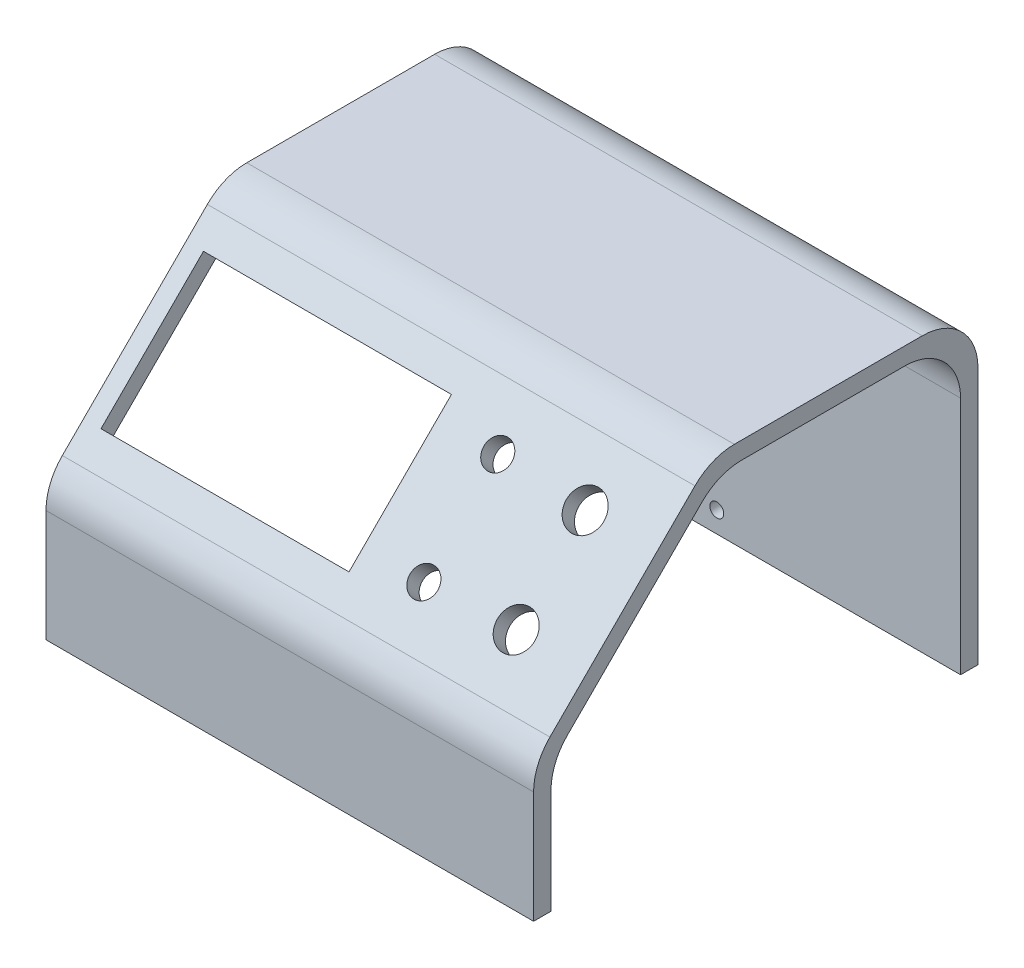
ISO-10303-21;
HEADER;
FILE_DESCRIPTION(('STEP AP214'),'2;1');
FILE_NAME('part.step','',(''),(''),'','','');
FILE_SCHEMA(('AUTOMOTIVE_DESIGN { 1 0 10303 214 1 1 1 1 }'));
ENDSEC;
DATA;
#1=APPLICATION_CONTEXT('core data for automotive mechanical design processes');
#2=APPLICATION_PROTOCOL_DEFINITION('international standard','automotive_design',2000,#1);
#3=PRODUCT_CONTEXT('',#1,'mechanical');
#4=PRODUCT('Part','Part','',(#3));
#5=PRODUCT_RELATED_PRODUCT_CATEGORY('part','',(#4));
#6=PRODUCT_DEFINITION_FORMATION('','',#4);
#7=PRODUCT_DEFINITION_CONTEXT('part definition',#1,'design');
#8=PRODUCT_DEFINITION('design','',#6,#7);
#9=PRODUCT_DEFINITION_SHAPE('','',#8);
#10=(LENGTH_UNIT() NAMED_UNIT(*) SI_UNIT(.MILLI.,.METRE.));
#11=(NAMED_UNIT(*) PLANE_ANGLE_UNIT() SI_UNIT($,.RADIAN.));
#12=(NAMED_UNIT(*) SI_UNIT($,.STERADIAN.) SOLID_ANGLE_UNIT());
#13=UNCERTAINTY_MEASURE_WITH_UNIT(LENGTH_MEASURE(1.E-05),#10,'distance_accuracy_value','');
#14=(GEOMETRIC_REPRESENTATION_CONTEXT(3) GLOBAL_UNCERTAINTY_ASSIGNED_CONTEXT((#13)) GLOBAL_UNIT_ASSIGNED_CONTEXT((#10,
#11,#12)) REPRESENTATION_CONTEXT('',''));
#15=CARTESIAN_POINT('',(0.,0.,0.));
#16=DIRECTION('',(0.,0.,1.));
#17=DIRECTION('',(1.,0.,0.));
#18=AXIS2_PLACEMENT_3D('',#15,#16,#17);
#19=CARTESIAN_POINT('',(88.9,0.,3.175));
#20=DIRECTION('',(0.,1.,0.));
#21=DIRECTION('',(0.,0.,1.));
#22=AXIS2_PLACEMENT_3D('',#19,#20,#21);
#23=PLANE('',#22);
#24=DIRECTION('',(0.,0.,-1.));
#25=VECTOR('',#24,1.);
#26=CARTESIAN_POINT('',(0.,0.,3.175));
#27=LINE('',#26,#25);
#28=CARTESIAN_POINT('',(0.,0.,3.175));
#29=VERTEX_POINT('',#28);
#30=CARTESIAN_POINT('',(0.,0.,0.));
#31=VERTEX_POINT('',#30);
#32=EDGE_CURVE('E328',#29,#31,#27,.T.);
#33=ORIENTED_EDGE('',*,*,#32,.T.);
#34=DIRECTION('',(-1.,0.,0.));
#35=VECTOR('',#34,1.);
#36=CARTESIAN_POINT('',(88.9,0.,0.));
#37=LINE('',#36,#35);
#38=CARTESIAN_POINT('',(88.9,0.,0.));
#39=VERTEX_POINT('',#38);
#40=EDGE_CURVE('E226',#39,#31,#37,.T.);
#41=ORIENTED_EDGE('',*,*,#40,.F.);
#42=DIRECTION('',(0.,0.,-1.));
#43=VECTOR('',#42,1.);
#44=CARTESIAN_POINT('',(88.9,0.,3.175));
#45=LINE('',#44,#43);
#46=CARTESIAN_POINT('',(88.9,0.,3.175));
#47=VERTEX_POINT('',#46);
#48=EDGE_CURVE('E350',#47,#39,#45,.T.);
#49=ORIENTED_EDGE('',*,*,#48,.F.);
#50=DIRECTION('',(-1.,0.,0.));
#51=VECTOR('',#50,1.);
#52=CARTESIAN_POINT('',(88.9,0.,3.175));
#53=LINE('',#52,#51);
#54=EDGE_CURVE('E327',#47,#29,#53,.T.);
#55=ORIENTED_EDGE('',*,*,#54,.T.);
#56=EDGE_LOOP('',(#33,#41,#49,#55));
#57=FACE_BOUND('',#56,.T.);
#58=ADVANCED_FACE('F33',(#57),#23,.F.);
#59=CARTESIAN_POINT('',(88.9,0.,0.));
#60=DIRECTION('',(0.,0.,1.));
#61=DIRECTION('',(0.,-1.,0.));
#62=AXIS2_PLACEMENT_3D('',#59,#60,#61);
#63=PLANE('',#62);
#64=DIRECTION('',(0.,1.,0.));
#65=VECTOR('',#64,1.);
#66=CARTESIAN_POINT('',(0.,0.,0.));
#67=LINE('',#66,#65);
#68=CARTESIAN_POINT('',(0.,19.1067193946543,0.));
#69=VERTEX_POINT('',#68);
#70=EDGE_CURVE('E295',#31,#69,#67,.T.);
#71=ORIENTED_EDGE('',*,*,#70,.T.);
#72=DIRECTION('',(-1.,0.,0.));
#73=VECTOR('',#72,1.);
#74=CARTESIAN_POINT('',(88.9,19.1067193946543,0.));
#75=LINE('',#74,#73);
#76=CARTESIAN_POINT('',(88.9,19.1067193946543,0.));
#77=VERTEX_POINT('',#76);
#78=EDGE_CURVE('E262',#69,#77,#75,.F.);
#79=ORIENTED_EDGE('',*,*,#78,.T.);
#80=DIRECTION('',(0.,1.,0.));
#81=VECTOR('',#80,1.);
#82=CARTESIAN_POINT('',(88.9,0.,0.));
#83=LINE('',#82,#81);
#84=EDGE_CURVE('E312',#39,#77,#83,.T.);
#85=ORIENTED_EDGE('',*,*,#84,.F.);
#86=ORIENTED_EDGE('',*,*,#40,.T.);
#87=EDGE_LOOP('',(#71,#79,#85,#86));
#88=FACE_BOUND('',#87,.T.);
#89=ADVANCED_FACE('F490',(#88),#63,.F.);
#90=CARTESIAN_POINT('',(88.9,23.3151291883649,0.));
#91=DIRECTION('',(0.,0.707106781186549,0.707106781186546));
#92=DIRECTION('',(0.,-0.707106781186546,0.707106781186549));
#93=AXIS2_PLACEMENT_3D('',#90,#91,#92);
#94=PLANE('',#93);
#95=DIRECTION('',(1.,0.,0.));
#96=VECTOR('',#95,1.);
#97=CARTESIAN_POINT('',(3.175,47.9210309600944,-24.6059017717295));
#98=LINE('',#97,#96);
#99=CARTESIAN_POINT('',(3.175,47.9210309600944,-24.6059017717295));
#100=VERTEX_POINT('',#99);
#101=CARTESIAN_POINT('',(48.387,47.9210309600944,-24.6059017717295));
#102=VERTEX_POINT('',#101);
#103=EDGE_CURVE('E450',#100,#102,#98,.T.);
#104=ORIENTED_EDGE('',*,*,#103,.F.);
#105=DIRECTION('',(0.,0.707106781186546,-0.707106781186549));
#106=VECTOR('',#105,1.);
#107=CARTESIAN_POINT('',(3.175,47.9210309600944,-24.6059017717295));
#108=LINE('',#107,#106);
#109=CARTESIAN_POINT('',(3.175,29.2420982282706,-5.92696903990566));
#110=VERTEX_POINT('',#109);
#111=EDGE_CURVE('E447',#110,#100,#108,.T.);
#112=ORIENTED_EDGE('',*,*,#111,.F.);
#113=DIRECTION('',(-1.,0.,0.));
#114=VECTOR('',#113,1.);
#115=CARTESIAN_POINT('',(3.175,29.2420982282706,-5.92696903990566));
#116=LINE('',#115,#114);
#117=CARTESIAN_POINT('',(48.387,29.2420982282706,-5.92696903990565));
#118=VERTEX_POINT('',#117);
#119=EDGE_CURVE('E331',#118,#110,#116,.T.);
#120=ORIENTED_EDGE('',*,*,#119,.F.);
#121=DIRECTION('',(0.,-0.707106781186546,0.707106781186549));
#122=VECTOR('',#121,1.);
#123=CARTESIAN_POINT('',(48.387,47.9210309600944,-24.6059017717295));
#124=LINE('',#123,#122);
#125=EDGE_CURVE('E422',#102,#118,#124,.T.);
#126=ORIENTED_EDGE('',*,*,#125,.F.);
#127=EDGE_LOOP('',(#104,#112,#120,#126));
#128=FACE_BOUND('',#127,.T.);
#129=CARTESIAN_POINT('',(75.819,44.8677438789309,-21.552614690566));
#130=DIRECTION('',(0.,0.707106781186549,0.707106781186546));
#131=DIRECTION('',(0.,-0.707106781186546,0.707106781186549));
#132=AXIS2_PLACEMENT_3D('',#129,#130,#131);
#133=CIRCLE('',#132,3.429);
#134=CARTESIAN_POINT('',(75.819,42.4430747262422,-19.1279455378773));
#135=VERTEX_POINT('',#134);
#136=EDGE_CURVE('E419',#135,#135,#133,.F.);
#137=ORIENTED_EDGE('',*,*,#136,.F.);
#138=EDGE_LOOP('',(#137));
#139=FACE_BOUND('',#138,.T.);
#140=CARTESIAN_POINT('',(75.819,32.2953853094341,-8.98025612106918));
#141=DIRECTION('',(0.,0.707106781186549,0.707106781186546));
#142=DIRECTION('',(0.,-0.707106781186546,0.707106781186549));
#143=AXIS2_PLACEMENT_3D('',#140,#141,#142);
#144=CIRCLE('',#143,3.429);
#145=CARTESIAN_POINT('',(75.819,29.8707161567454,-6.55558696838051));
#146=VERTEX_POINT('',#145);
#147=EDGE_CURVE('E413',#146,#146,#144,.F.);
#148=ORIENTED_EDGE('',*,*,#147,.F.);
#149=EDGE_LOOP('',(#148));
#150=FACE_BOUND('',#149,.T.);
#151=CARTESIAN_POINT('',(59.436,45.3167566849843,-22.0016274966195));
#152=DIRECTION('',(0.,0.707106781186549,0.707106781186546));
#153=DIRECTION('',(0.,-0.707106781186546,0.707106781186549));
#154=AXIS2_PLACEMENT_3D('',#151,#152,#153);
#155=CIRCLE('',#154,2.54);
#156=CARTESIAN_POINT('',(59.436,43.5207054607705,-20.2055762724056));
#157=VERTEX_POINT('',#156);
#158=EDGE_CURVE('E407',#157,#157,#155,.F.);
#159=ORIENTED_EDGE('',*,*,#158,.F.);
#160=EDGE_LOOP('',(#159));
#161=FACE_BOUND('',#160,.T.);
#162=CARTESIAN_POINT('',(59.436,31.8463725033806,-8.53124331501572));
#163=DIRECTION('',(0.,0.707106781186549,0.707106781186546));
#164=DIRECTION('',(0.,-0.707106781186546,0.707106781186549));
#165=AXIS2_PLACEMENT_3D('',#162,#163,#164);
#166=CIRCLE('',#165,2.54);
#167=CARTESIAN_POINT('',(59.436,30.0503212791668,-6.73519209080188));
#168=VERTEX_POINT('',#167);
#169=EDGE_CURVE('E401',#168,#168,#166,.F.);
#170=ORIENTED_EDGE('',*,*,#169,.F.);
#171=EDGE_LOOP('',(#170));
#172=FACE_BOUND('',#171,.T.);
#173=DIRECTION('',(0.,0.707106781186546,-0.707106781186549));
#174=VECTOR('',#173,1.);
#175=CARTESIAN_POINT('',(88.9,23.3151291883649,0.));
#176=LINE('',#175,#174);
#177=CARTESIAN_POINT('',(88.9,26.2909242915096,-2.97579510314469));
#178=VERTEX_POINT('',#177);
#179=CARTESIAN_POINT('',(88.9,50.8722048968553,-27.5570757084905));
#180=VERTEX_POINT('',#179);
#181=EDGE_CURVE('E305',#178,#180,#176,.T.);
#182=ORIENTED_EDGE('',*,*,#181,.F.);
#183=DIRECTION('',(-1.,0.,0.));
#184=VECTOR('',#183,1.);
#185=CARTESIAN_POINT('',(0.,26.2909242915096,-2.97579510314469));
#186=LINE('',#185,#184);
#187=CARTESIAN_POINT('',(0.,26.2909242915096,-2.97579510314469));
#188=VERTEX_POINT('',#187);
#189=EDGE_CURVE('E259',#178,#188,#186,.T.);
#190=ORIENTED_EDGE('',*,*,#189,.T.);
#191=DIRECTION('',(0.,0.707106781186546,-0.707106781186549));
#192=VECTOR('',#191,1.);
#193=CARTESIAN_POINT('',(0.,23.3151291883649,0.));
#194=LINE('',#193,#192);
#195=CARTESIAN_POINT('',(0.,50.8722048968553,-27.5570757084905));
#196=VERTEX_POINT('',#195);
#197=EDGE_CURVE('E284',#188,#196,#194,.T.);
#198=ORIENTED_EDGE('',*,*,#197,.T.);
#199=DIRECTION('',(-1.,0.,0.));
#200=VECTOR('',#199,1.);
#201=CARTESIAN_POINT('',(88.9,50.8722048968553,-27.5570757084905));
#202=LINE('',#201,#200);
#203=EDGE_CURVE('E257',#196,#180,#202,.F.);
#204=ORIENTED_EDGE('',*,*,#203,.T.);
#205=EDGE_LOOP('',(#182,#190,#198,#204));
#206=FACE_BOUND('',#205,.T.);
#207=ADVANCED_FACE('F292',(#128,#139,#150,#161,#172,#206),#94,.F.);
#208=CARTESIAN_POINT('',(88.9,53.848,-30.5328708116352));
#209=DIRECTION('',(0.,1.,0.));
#210=DIRECTION('',(0.,0.,1.));
#211=AXIS2_PLACEMENT_3D('',#208,#209,#210);
#212=PLANE('',#211);
#213=DIRECTION('',(0.,0.,-1.));
#214=VECTOR('',#213,1.);
#215=CARTESIAN_POINT('',(0.,53.848,-30.5328708116352));
#216=LINE('',#215,#214);
#217=CARTESIAN_POINT('',(0.,53.848,-34.7412806053458));
#218=VERTEX_POINT('',#217);
#219=CARTESIAN_POINT('',(0.,53.848,-64.516));
#220=VERTEX_POINT('',#219);
#221=EDGE_CURVE('E286',#218,#220,#216,.T.);
#222=ORIENTED_EDGE('',*,*,#221,.T.);
#223=DIRECTION('',(-1.,0.,0.));
#224=VECTOR('',#223,1.);
#225=CARTESIAN_POINT('',(88.9,53.848,-64.516));
#226=LINE('',#225,#224);
#227=CARTESIAN_POINT('',(88.9,53.848,-64.516));
#228=VERTEX_POINT('',#227);
#229=EDGE_CURVE('E236',#220,#228,#226,.F.);
#230=ORIENTED_EDGE('',*,*,#229,.T.);
#231=DIRECTION('',(0.,0.,-1.));
#232=VECTOR('',#231,1.);
#233=CARTESIAN_POINT('',(88.9,53.848,-30.5328708116352));
#234=LINE('',#233,#232);
#235=CARTESIAN_POINT('',(88.9,53.848,-34.7412806053458));
#236=VERTEX_POINT('',#235);
#237=EDGE_CURVE('E304',#236,#228,#234,.T.);
#238=ORIENTED_EDGE('',*,*,#237,.F.);
#239=DIRECTION('',(-1.,0.,0.));
#240=VECTOR('',#239,1.);
#241=CARTESIAN_POINT('',(0.,53.848,-34.7412806053458));
#242=LINE('',#241,#240);
#243=EDGE_CURVE('E228',#236,#218,#242,.T.);
#244=ORIENTED_EDGE('',*,*,#243,.T.);
#245=EDGE_LOOP('',(#222,#230,#238,#244));
#246=FACE_BOUND('',#245,.T.);
#247=ADVANCED_FACE('F307',(#246),#212,.F.);
#248=CARTESIAN_POINT('',(88.9,53.848,-74.676));
#249=DIRECTION('',(0.,0.,-1.));
#250=DIRECTION('',(-1.,0.,0.));
#251=AXIS2_PLACEMENT_3D('',#248,#249,#250);
#252=PLANE('',#251);
#253=CARTESIAN_POINT('',(44.45,3.81,-74.676));
#254=DIRECTION('',(0.,0.,-1.));
#255=DIRECTION('',(-1.,0.,0.));
#256=AXIS2_PLACEMENT_3D('',#253,#254,#255);
#257=CIRCLE('',#256,1.27);
#258=CARTESIAN_POINT('',(43.18,3.81,-74.676));
#259=VERTEX_POINT('',#258);
#260=EDGE_CURVE('E457',#259,#259,#257,.F.);
#261=ORIENTED_EDGE('',*,*,#260,.F.);
#262=EDGE_LOOP('',(#261));
#263=FACE_BOUND('',#262,.T.);
#264=DIRECTION('',(1.,0.,0.));
#265=VECTOR('',#264,1.);
#266=CARTESIAN_POINT('',(3.175,18.288,-74.676));
#267=LINE('',#266,#265);
#268=CARTESIAN_POINT('',(3.175,18.288,-74.676));
#269=VERTEX_POINT('',#268);
#270=CARTESIAN_POINT('',(31.115,18.288,-74.676));
#271=VERTEX_POINT('',#270);
#272=EDGE_CURVE('E218',#269,#271,#267,.T.);
#273=ORIENTED_EDGE('',*,*,#272,.F.);
#274=DIRECTION('',(0.,-1.,0.));
#275=VECTOR('',#274,1.);
#276=CARTESIAN_POINT('',(3.175,43.688,-74.676));
#277=LINE('',#276,#275);
#278=CARTESIAN_POINT('',(3.175,43.688,-74.676));
#279=VERTEX_POINT('',#278);
#280=EDGE_CURVE('E195',#279,#269,#277,.T.);
#281=ORIENTED_EDGE('',*,*,#280,.F.);
#282=DIRECTION('',(-1.,0.,0.));
#283=VECTOR('',#282,1.);
#284=CARTESIAN_POINT('',(0.,43.688,-74.676));
#285=LINE('',#284,#283);
#286=CARTESIAN_POINT('',(0.,43.688,-74.676));
#287=VERTEX_POINT('',#286);
#288=EDGE_CURVE('E215',#279,#287,#285,.T.);
#289=ORIENTED_EDGE('',*,*,#288,.T.);
#290=DIRECTION('',(0.,-1.,0.));
#291=VECTOR('',#290,1.);
#292=CARTESIAN_POINT('',(0.,53.848,-74.676));
#293=LINE('',#292,#291);
#294=CARTESIAN_POINT('',(0.,0.,-74.676));
#295=VERTEX_POINT('',#294);
#296=EDGE_CURVE('E335',#287,#295,#293,.T.);
#297=ORIENTED_EDGE('',*,*,#296,.T.);
#298=DIRECTION('',(-1.,0.,0.));
#299=VECTOR('',#298,1.);
#300=CARTESIAN_POINT('',(88.9,0.,-74.676));
#301=LINE('',#300,#299);
#302=CARTESIAN_POINT('',(88.9,0.,-74.676));
#303=VERTEX_POINT('',#302);
#304=EDGE_CURVE('E230',#303,#295,#301,.T.);
#305=ORIENTED_EDGE('',*,*,#304,.F.);
#306=DIRECTION('',(0.,-1.,0.));
#307=VECTOR('',#306,1.);
#308=CARTESIAN_POINT('',(88.9,53.848,-74.676));
#309=LINE('',#308,#307);
#310=CARTESIAN_POINT('',(88.9,43.688,-74.676));
#311=VERTEX_POINT('',#310);
#312=EDGE_CURVE('E308',#311,#303,#309,.T.);
#313=ORIENTED_EDGE('',*,*,#312,.F.);
#314=CARTESIAN_POINT('',(31.115,43.688,-74.676));
#315=VERTEX_POINT('',#314);
#316=EDGE_CURVE('E225',#311,#315,#285,.T.);
#317=ORIENTED_EDGE('',*,*,#316,.T.);
#318=DIRECTION('',(0.,1.,0.));
#319=VECTOR('',#318,1.);
#320=CARTESIAN_POINT('',(31.115,43.688,-74.676));
#321=LINE('',#320,#319);
#322=EDGE_CURVE('E56',#271,#315,#321,.T.);
#323=ORIENTED_EDGE('',*,*,#322,.F.);
#324=EDGE_LOOP('',(#273,#281,#289,#297,#305,#313,#317,#323));
#325=FACE_BOUND('',#324,.T.);
#326=ADVANCED_FACE('F214',(#263,#325),#252,.F.);
#327=CARTESIAN_POINT('',(88.9,0.,-74.676));
#328=DIRECTION('',(0.,1.,0.));
#329=DIRECTION('',(0.,0.,1.));
#330=AXIS2_PLACEMENT_3D('',#327,#328,#329);
#331=PLANE('',#330);
#332=DIRECTION('',(0.,0.,-1.));
#333=VECTOR('',#332,1.);
#334=CARTESIAN_POINT('',(0.,0.,-74.676));
#335=LINE('',#334,#333);
#336=CARTESIAN_POINT('',(0.,0.,-77.851));
#337=VERTEX_POINT('',#336);
#338=EDGE_CURVE('E337',#295,#337,#335,.T.);
#339=ORIENTED_EDGE('',*,*,#338,.T.);
#340=DIRECTION('',(-1.,0.,0.));
#341=VECTOR('',#340,1.);
#342=CARTESIAN_POINT('',(88.9,0.,-77.851));
#343=LINE('',#342,#341);
#344=CARTESIAN_POINT('',(88.9,0.,-77.851));
#345=VERTEX_POINT('',#344);
#346=EDGE_CURVE('E353',#345,#337,#343,.T.);
#347=ORIENTED_EDGE('',*,*,#346,.F.);
#348=DIRECTION('',(0.,0.,-1.));
#349=VECTOR('',#348,1.);
#350=CARTESIAN_POINT('',(88.9,0.,-74.676));
#351=LINE('',#350,#349);
#352=EDGE_CURVE('E310',#303,#345,#351,.T.);
#353=ORIENTED_EDGE('',*,*,#352,.F.);
#354=ORIENTED_EDGE('',*,*,#304,.T.);
#355=EDGE_LOOP('',(#339,#347,#353,#354));
#356=FACE_BOUND('',#355,.T.);
#357=ADVANCED_FACE('F360',(#356),#331,.F.);
#358=CARTESIAN_POINT('',(88.9,0.,-77.851));
#359=DIRECTION('',(0.,0.,1.));
#360=DIRECTION('',(0.,-1.,0.));
#361=AXIS2_PLACEMENT_3D('',#358,#359,#360);
#362=PLANE('',#361);
#363=DIRECTION('',(1.,0.,0.));
#364=VECTOR('',#363,1.);
#365=CARTESIAN_POINT('',(3.175,43.688,-77.851));
#366=LINE('',#365,#364);
#367=CARTESIAN_POINT('',(3.175,43.688,-77.851));
#368=VERTEX_POINT('',#367);
#369=CARTESIAN_POINT('',(31.115,43.688,-77.851));
#370=VERTEX_POINT('',#369);
#371=EDGE_CURVE('E469',#368,#370,#366,.T.);
#372=ORIENTED_EDGE('',*,*,#371,.F.);
#373=DIRECTION('',(0.,1.,0.));
#374=VECTOR('',#373,1.);
#375=CARTESIAN_POINT('',(3.175,43.688,-77.851));
#376=LINE('',#375,#374);
#377=CARTESIAN_POINT('',(3.175,18.288,-77.851));
#378=VERTEX_POINT('',#377);
#379=EDGE_CURVE('E48',#378,#368,#376,.T.);
#380=ORIENTED_EDGE('',*,*,#379,.F.);
#381=DIRECTION('',(-1.,0.,0.));
#382=VECTOR('',#381,1.);
#383=CARTESIAN_POINT('',(3.175,18.288,-77.851));
#384=LINE('',#383,#382);
#385=CARTESIAN_POINT('',(31.115,18.288,-77.851));
#386=VERTEX_POINT('',#385);
#387=EDGE_CURVE('E201',#386,#378,#384,.T.);
#388=ORIENTED_EDGE('',*,*,#387,.F.);
#389=DIRECTION('',(0.,-1.,0.));
#390=VECTOR('',#389,1.);
#391=CARTESIAN_POINT('',(31.115,43.688,-77.851));
#392=LINE('',#391,#390);
#393=EDGE_CURVE('E466',#370,#386,#392,.T.);
#394=ORIENTED_EDGE('',*,*,#393,.F.);
#395=EDGE_LOOP('',(#372,#380,#388,#394));
#396=FACE_BOUND('',#395,.T.);
#397=CARTESIAN_POINT('',(44.45,3.81,-77.851));
#398=DIRECTION('',(0.,0.,-1.));
#399=DIRECTION('',(-1.,0.,0.));
#400=AXIS2_PLACEMENT_3D('',#397,#398,#399);
#401=CIRCLE('',#400,1.27);
#402=CARTESIAN_POINT('',(43.18,3.81,-77.851));
#403=VERTEX_POINT('',#402);
#404=EDGE_CURVE('E454',#403,#403,#401,.T.);
#405=ORIENTED_EDGE('',*,*,#404,.F.);
#406=EDGE_LOOP('',(#405));
#407=FACE_BOUND('',#406,.T.);
#408=DIRECTION('',(0.,1.,0.));
#409=VECTOR('',#408,1.);
#410=CARTESIAN_POINT('',(0.,0.,-77.851));
#411=LINE('',#410,#409);
#412=CARTESIAN_POINT('',(0.,46.863,-77.851));
#413=VERTEX_POINT('',#412);
#414=EDGE_CURVE('E339',#337,#413,#411,.T.);
#415=ORIENTED_EDGE('',*,*,#414,.T.);
#416=DIRECTION('',(-1.,0.,0.));
#417=VECTOR('',#416,1.);
#418=CARTESIAN_POINT('',(88.9,46.863,-77.851));
#419=LINE('',#418,#417);
#420=CARTESIAN_POINT('',(88.9,46.863,-77.851));
#421=VERTEX_POINT('',#420);
#422=EDGE_CURVE('E249',#413,#421,#419,.F.);
#423=ORIENTED_EDGE('',*,*,#422,.T.);
#424=DIRECTION('',(0.,1.,0.));
#425=VECTOR('',#424,1.);
#426=CARTESIAN_POINT('',(88.9,0.,-77.851));
#427=LINE('',#426,#425);
#428=EDGE_CURVE('E317',#345,#421,#427,.T.);
#429=ORIENTED_EDGE('',*,*,#428,.F.);
#430=ORIENTED_EDGE('',*,*,#346,.T.);
#431=EDGE_LOOP('',(#415,#423,#429,#430));
#432=FACE_BOUND('',#431,.T.);
#433=ADVANCED_FACE('F366',(#396,#407,#432),#362,.F.);
#434=CARTESIAN_POINT('',(88.9,57.023,-77.851));
#435=DIRECTION('',(0.,-1.,0.));
#436=DIRECTION('',(0.,0.,-1.));
#437=AXIS2_PLACEMENT_3D('',#434,#435,#436);
#438=PLANE('',#437);
#439=DIRECTION('',(0.,0.,1.));
#440=VECTOR('',#439,1.);
#441=CARTESIAN_POINT('',(88.9,57.023,-77.851));
#442=LINE('',#441,#440);
#443=CARTESIAN_POINT('',(88.9,57.023,-67.691));
#444=VERTEX_POINT('',#443);
#445=CARTESIAN_POINT('',(88.9,57.023,-33.4261525448112));
#446=VERTEX_POINT('',#445);
#447=EDGE_CURVE('E319',#444,#446,#442,.T.);
#448=ORIENTED_EDGE('',*,*,#447,.F.);
#449=DIRECTION('',(-1.,0.,0.));
#450=VECTOR('',#449,1.);
#451=CARTESIAN_POINT('',(88.9,57.023,-67.691));
#452=LINE('',#451,#450);
#453=CARTESIAN_POINT('',(0.,57.023,-67.691));
#454=VERTEX_POINT('',#453);
#455=EDGE_CURVE('E240',#444,#454,#452,.T.);
#456=ORIENTED_EDGE('',*,*,#455,.T.);
#457=DIRECTION('',(0.,0.,1.));
#458=VECTOR('',#457,1.);
#459=CARTESIAN_POINT('',(0.,57.023,-77.851));
#460=LINE('',#459,#458);
#461=CARTESIAN_POINT('',(0.,57.023,-33.4261525448112));
#462=VERTEX_POINT('',#461);
#463=EDGE_CURVE('E342',#454,#462,#460,.T.);
#464=ORIENTED_EDGE('',*,*,#463,.T.);
#465=DIRECTION('',(-1.,0.,0.));
#466=VECTOR('',#465,1.);
#467=CARTESIAN_POINT('',(88.9,57.023,-33.4261525448112));
#468=LINE('',#467,#466);
#469=EDGE_CURVE('E238',#462,#446,#468,.F.);
#470=ORIENTED_EDGE('',*,*,#469,.T.);
#471=EDGE_LOOP('',(#448,#456,#464,#470));
#472=FACE_BOUND('',#471,.T.);
#473=ADVANCED_FACE('F375',(#472),#438,.F.);
#474=CARTESIAN_POINT('',(88.9,57.023,-29.2177427511006));
#475=DIRECTION('',(0.,-0.707106781186549,-0.707106781186546));
#476=DIRECTION('',(0.,0.707106781186546,-0.707106781186549));
#477=AXIS2_PLACEMENT_3D('',#474,#475,#476);
#478=PLANE('',#477);
#479=DIRECTION('',(1.,0.,0.));
#480=VECTOR('',#479,1.);
#481=CARTESIAN_POINT('',(3.175,31.4871622585379,-3.68190500963837));
#482=LINE('',#481,#480);
#483=CARTESIAN_POINT('',(3.175,31.4871622585379,-3.68190500963837));
#484=VERTEX_POINT('',#483);
#485=CARTESIAN_POINT('',(48.387,31.4871622585379,-3.68190500963836));
#486=VERTEX_POINT('',#485);
#487=EDGE_CURVE('E442',#484,#486,#482,.T.);
#488=ORIENTED_EDGE('',*,*,#487,.F.);
#489=DIRECTION('',(0.,-0.707106781186546,0.707106781186549));
#490=VECTOR('',#489,1.);
#491=CARTESIAN_POINT('',(3.175,50.1660949903617,-22.3608377414622));
#492=LINE('',#491,#490);
#493=CARTESIAN_POINT('',(3.175,50.1660949903617,-22.3608377414622));
#494=VERTEX_POINT('',#493);
#495=EDGE_CURVE('E445',#494,#484,#492,.T.);
#496=ORIENTED_EDGE('',*,*,#495,.F.);
#497=DIRECTION('',(-1.,0.,0.));
#498=VECTOR('',#497,1.);
#499=CARTESIAN_POINT('',(3.175,50.1660949903617,-22.3608377414622));
#500=LINE('',#499,#498);
#501=CARTESIAN_POINT('',(48.387,50.1660949903617,-22.3608377414622));
#502=VERTEX_POINT('',#501);
#503=EDGE_CURVE('E432',#502,#494,#500,.T.);
#504=ORIENTED_EDGE('',*,*,#503,.F.);
#505=DIRECTION('',(0.,0.707106781186546,-0.707106781186549));
#506=VECTOR('',#505,1.);
#507=CARTESIAN_POINT('',(48.387,50.1660949903617,-22.3608377414622));
#508=LINE('',#507,#506);
#509=EDGE_CURVE('E439',#486,#502,#508,.T.);
#510=ORIENTED_EDGE('',*,*,#509,.F.);
#511=EDGE_LOOP('',(#488,#496,#504,#510));
#512=FACE_BOUND('',#511,.T.);
#513=CARTESIAN_POINT('',(75.819,47.1128079091982,-19.3075506602987));
#514=DIRECTION('',(0.,0.707106781186549,0.707106781186546));
#515=DIRECTION('',(0.,-0.707106781186546,0.707106781186549));
#516=AXIS2_PLACEMENT_3D('',#513,#514,#515);
#517=CIRCLE('',#516,3.429);
#518=CARTESIAN_POINT('',(75.819,44.6881387565095,-16.88288150761));
#519=VERTEX_POINT('',#518);
#520=EDGE_CURVE('E416',#519,#519,#517,.T.);
#521=ORIENTED_EDGE('',*,*,#520,.F.);
#522=EDGE_LOOP('',(#521));
#523=FACE_BOUND('',#522,.T.);
#524=CARTESIAN_POINT('',(75.819,34.5404493397014,-6.73519209080188));
#525=DIRECTION('',(0.,0.707106781186549,0.707106781186546));
#526=DIRECTION('',(0.,-0.707106781186546,0.707106781186549));
#527=AXIS2_PLACEMENT_3D('',#524,#525,#526);
#528=CIRCLE('',#527,3.429);
#529=CARTESIAN_POINT('',(75.819,32.1157801870127,-4.31052293811321));
#530=VERTEX_POINT('',#529);
#531=EDGE_CURVE('E410',#530,#530,#528,.T.);
#532=ORIENTED_EDGE('',*,*,#531,.F.);
#533=EDGE_LOOP('',(#532));
#534=FACE_BOUND('',#533,.T.);
#535=CARTESIAN_POINT('',(59.436,47.5618207152516,-19.7565634663522));
#536=DIRECTION('',(0.,0.707106781186549,0.707106781186546));
#537=DIRECTION('',(0.,-0.707106781186546,0.707106781186549));
#538=AXIS2_PLACEMENT_3D('',#535,#536,#537);
#539=CIRCLE('',#538,2.54);
#540=CARTESIAN_POINT('',(59.436,45.7657694910378,-17.9605122421383));
#541=VERTEX_POINT('',#540);
#542=EDGE_CURVE('E404',#541,#541,#539,.T.);
#543=ORIENTED_EDGE('',*,*,#542,.F.);
#544=EDGE_LOOP('',(#543));
#545=FACE_BOUND('',#544,.T.);
#546=CARTESIAN_POINT('',(59.436,34.0914365336479,-6.28617928474842));
#547=DIRECTION('',(0.,0.707106781186549,0.707106781186546));
#548=DIRECTION('',(0.,-0.707106781186546,0.707106781186549));
#549=AXIS2_PLACEMENT_3D('',#546,#547,#548);
#550=CIRCLE('',#549,2.54);
#551=CARTESIAN_POINT('',(59.436,32.2953853094341,-4.49012806053459));
#552=VERTEX_POINT('',#551);
#553=EDGE_CURVE('E210',#552,#552,#550,.T.);
#554=ORIENTED_EDGE('',*,*,#553,.F.);
#555=EDGE_LOOP('',(#554));
#556=FACE_BOUND('',#555,.T.);
#557=DIRECTION('',(0.,-0.707106781186546,0.707106781186549));
#558=VECTOR('',#557,1.);
#559=CARTESIAN_POINT('',(0.,57.023,-29.2177427511006));
#560=LINE('',#559,#558);
#561=CARTESIAN_POINT('',(0.,54.0472048968553,-26.2419476479559));
#562=VERTEX_POINT('',#561);
#563=CARTESIAN_POINT('',(0.,27.6060523520442,0.199204896855314));
#564=VERTEX_POINT('',#563);
#565=EDGE_CURVE('E345',#562,#564,#560,.T.);
#566=ORIENTED_EDGE('',*,*,#565,.T.);
#567=DIRECTION('',(-1.,0.,0.));
#568=VECTOR('',#567,1.);
#569=CARTESIAN_POINT('',(88.9,27.6060523520442,0.19920489685531));
#570=LINE('',#569,#568);
#571=CARTESIAN_POINT('',(88.9,27.6060523520442,0.199204896855314));
#572=VERTEX_POINT('',#571);
#573=EDGE_CURVE('E270',#564,#572,#570,.F.);
#574=ORIENTED_EDGE('',*,*,#573,.T.);
#575=DIRECTION('',(0.,-0.707106781186546,0.707106781186549));
#576=VECTOR('',#575,1.);
#577=CARTESIAN_POINT('',(88.9,57.023,-29.2177427511006));
#578=LINE('',#577,#576);
#579=CARTESIAN_POINT('',(88.9,54.0472048968553,-26.2419476479559));
#580=VERTEX_POINT('',#579);
#581=EDGE_CURVE('E322',#580,#572,#578,.T.);
#582=ORIENTED_EDGE('',*,*,#581,.F.);
#583=DIRECTION('',(-1.,0.,0.));
#584=VECTOR('',#583,1.);
#585=CARTESIAN_POINT('',(88.9,54.0472048968553,-26.2419476479559));
#586=LINE('',#585,#584);
#587=EDGE_CURVE('E267',#580,#562,#586,.T.);
#588=ORIENTED_EDGE('',*,*,#587,.T.);
#589=EDGE_LOOP('',(#566,#574,#582,#588));
#590=FACE_BOUND('',#589,.T.);
#591=ADVANCED_FACE('F382',(#512,#523,#534,#545,#556,#590),#478,.F.);
#592=CARTESIAN_POINT('',(88.9,24.6302572488995,3.175));
#593=DIRECTION('',(0.,0.,-1.));
#594=DIRECTION('',(0.,1.,0.));
#595=AXIS2_PLACEMENT_3D('',#592,#593,#594);
#596=PLANE('',#595);
#597=DIRECTION('',(0.,-1.,0.));
#598=VECTOR('',#597,1.);
#599=CARTESIAN_POINT('',(88.9,24.6302572488995,3.175));
#600=LINE('',#599,#598);
#601=CARTESIAN_POINT('',(88.9,20.4218474551889,3.175));
#602=VERTEX_POINT('',#601);
#603=EDGE_CURVE('E325',#602,#47,#600,.T.);
#604=ORIENTED_EDGE('',*,*,#603,.F.);
#605=DIRECTION('',(-1.,0.,0.));
#606=VECTOR('',#605,1.);
#607=CARTESIAN_POINT('',(88.9,20.4218474551888,3.175));
#608=LINE('',#607,#606);
#609=CARTESIAN_POINT('',(0.,20.4218474551889,3.175));
#610=VERTEX_POINT('',#609);
#611=EDGE_CURVE('E264',#602,#610,#608,.T.);
#612=ORIENTED_EDGE('',*,*,#611,.T.);
#613=DIRECTION('',(0.,-1.,0.));
#614=VECTOR('',#613,1.);
#615=CARTESIAN_POINT('',(0.,24.6302572488995,3.175));
#616=LINE('',#615,#614);
#617=EDGE_CURVE('E348',#610,#29,#616,.T.);
#618=ORIENTED_EDGE('',*,*,#617,.T.);
#619=ORIENTED_EDGE('',*,*,#54,.F.);
#620=EDGE_LOOP('',(#604,#612,#618,#619));
#621=FACE_BOUND('',#620,.T.);
#622=ADVANCED_FACE('F392',(#621),#596,.F.);
#623=CARTESIAN_POINT('',(88.9,0.,0.));
#624=DIRECTION('',(1.,0.,0.));
#625=DIRECTION('',(0.,0.,-1.));
#626=AXIS2_PLACEMENT_3D('',#623,#624,#625);
#627=PLANE('',#626);
#628=ORIENTED_EDGE('',*,*,#428,.T.);
#629=CARTESIAN_POINT('',(88.9,46.863,-67.691));
#630=DIRECTION('',(1.,0.,0.));
#631=DIRECTION('',(0.,0.,-1.));
#632=AXIS2_PLACEMENT_3D('',#629,#630,#631);
#633=CIRCLE('',#632,10.16);
#634=EDGE_CURVE('E255',#421,#444,#633,.T.);
#635=ORIENTED_EDGE('',*,*,#634,.T.);
#636=ORIENTED_EDGE('',*,*,#447,.T.);
#637=CARTESIAN_POINT('',(88.9,46.863,-33.4261525448112));
#638=DIRECTION('',(1.,0.,0.));
#639=DIRECTION('',(0.,0.,-1.));
#640=AXIS2_PLACEMENT_3D('',#637,#638,#639);
#641=CIRCLE('',#640,10.16);
#642=EDGE_CURVE('E251',#446,#580,#641,.T.);
#643=ORIENTED_EDGE('',*,*,#642,.T.);
#644=ORIENTED_EDGE('',*,*,#581,.T.);
#645=CARTESIAN_POINT('',(88.9,20.4218474551889,-6.985));
#646=DIRECTION('',(1.,0.,0.));
#647=DIRECTION('',(0.,0.,-1.));
#648=AXIS2_PLACEMENT_3D('',#645,#646,#647);
#649=CIRCLE('',#648,10.16);
#650=EDGE_CURVE('E253',#572,#602,#649,.T.);
#651=ORIENTED_EDGE('',*,*,#650,.T.);
#652=ORIENTED_EDGE('',*,*,#603,.T.);
#653=ORIENTED_EDGE('',*,*,#48,.T.);
#654=ORIENTED_EDGE('',*,*,#84,.T.);
#655=CARTESIAN_POINT('',(88.9,19.1067193946543,-10.16));
#656=DIRECTION('',(1.,0.,0.));
#657=DIRECTION('',(0.,0.,-1.));
#658=AXIS2_PLACEMENT_3D('',#655,#656,#657);
#659=CIRCLE('',#658,10.16);
#660=EDGE_CURVE('E277',#77,#178,#659,.F.);
#661=ORIENTED_EDGE('',*,*,#660,.T.);
#662=ORIENTED_EDGE('',*,*,#181,.T.);
#663=CARTESIAN_POINT('',(88.9,43.688,-34.7412806053458));
#664=DIRECTION('',(1.,0.,0.));
#665=DIRECTION('',(0.,0.,-1.));
#666=AXIS2_PLACEMENT_3D('',#663,#664,#665);
#667=CIRCLE('',#666,10.16);
#668=EDGE_CURVE('E11',#180,#236,#667,.F.);
#669=ORIENTED_EDGE('',*,*,#668,.T.);
#670=ORIENTED_EDGE('',*,*,#237,.T.);
#671=CARTESIAN_POINT('',(88.9,43.688,-64.516));
#672=DIRECTION('',(1.,0.,0.));
#673=DIRECTION('',(0.,0.,-1.));
#674=AXIS2_PLACEMENT_3D('',#671,#672,#673);
#675=CIRCLE('',#674,10.16);
#676=EDGE_CURVE('E273',#228,#311,#675,.F.);
#677=ORIENTED_EDGE('',*,*,#676,.T.);
#678=ORIENTED_EDGE('',*,*,#312,.T.);
#679=ORIENTED_EDGE('',*,*,#352,.T.);
#680=EDGE_LOOP('',(#628,#635,#636,#643,#644,#651,#652,#653,#654,#661,#662,#669,#670,#677,#678,#679));
#681=FACE_BOUND('',#680,.T.);
#682=ADVANCED_FACE('F303',(#681),#627,.T.);
#683=CARTESIAN_POINT('',(0.,0.,0.));
#684=DIRECTION('',(1.,0.,0.));
#685=DIRECTION('',(0.,0.,-1.));
#686=AXIS2_PLACEMENT_3D('',#683,#684,#685);
#687=PLANE('',#686);
#688=ORIENTED_EDGE('',*,*,#463,.F.);
#689=CARTESIAN_POINT('',(0.,46.863,-67.691));
#690=DIRECTION('',(1.,0.,0.));
#691=DIRECTION('',(0.,0.,-1.));
#692=AXIS2_PLACEMENT_3D('',#689,#690,#691);
#693=CIRCLE('',#692,10.16);
#694=EDGE_CURVE('E247',#454,#413,#693,.F.);
#695=ORIENTED_EDGE('',*,*,#694,.T.);
#696=ORIENTED_EDGE('',*,*,#414,.F.);
#697=ORIENTED_EDGE('',*,*,#338,.F.);
#698=ORIENTED_EDGE('',*,*,#296,.F.);
#699=CARTESIAN_POINT('',(0.,43.688,-64.516));
#700=DIRECTION('',(1.,0.,0.));
#701=DIRECTION('',(0.,0.,-1.));
#702=AXIS2_PLACEMENT_3D('',#699,#700,#701);
#703=CIRCLE('',#702,10.16);
#704=EDGE_CURVE('E223',#287,#220,#703,.T.);
#705=ORIENTED_EDGE('',*,*,#704,.T.);
#706=ORIENTED_EDGE('',*,*,#221,.F.);
#707=CARTESIAN_POINT('',(0.,43.688,-34.7412806053458));
#708=DIRECTION('',(1.,0.,0.));
#709=DIRECTION('',(0.,0.,-1.));
#710=AXIS2_PLACEMENT_3D('',#707,#708,#709);
#711=CIRCLE('',#710,10.16);
#712=EDGE_CURVE('E41',#218,#196,#711,.T.);
#713=ORIENTED_EDGE('',*,*,#712,.T.);
#714=ORIENTED_EDGE('',*,*,#197,.F.);
#715=CARTESIAN_POINT('',(0.,19.1067193946543,-10.16));
#716=DIRECTION('',(1.,0.,0.));
#717=DIRECTION('',(0.,0.,-1.));
#718=AXIS2_PLACEMENT_3D('',#715,#716,#717);
#719=CIRCLE('',#718,10.16);
#720=EDGE_CURVE('E275',#188,#69,#719,.T.);
#721=ORIENTED_EDGE('',*,*,#720,.T.);
#722=ORIENTED_EDGE('',*,*,#70,.F.);
#723=ORIENTED_EDGE('',*,*,#32,.F.);
#724=ORIENTED_EDGE('',*,*,#617,.F.);
#725=CARTESIAN_POINT('',(0.,20.4218474551889,-6.985));
#726=DIRECTION('',(1.,0.,0.));
#727=DIRECTION('',(0.,0.,-1.));
#728=AXIS2_PLACEMENT_3D('',#725,#726,#727);
#729=CIRCLE('',#728,10.16);
#730=EDGE_CURVE('E245',#610,#564,#729,.F.);
#731=ORIENTED_EDGE('',*,*,#730,.T.);
#732=ORIENTED_EDGE('',*,*,#565,.F.);
#733=CARTESIAN_POINT('',(0.,46.863,-33.4261525448112));
#734=DIRECTION('',(1.,0.,0.));
#735=DIRECTION('',(0.,0.,-1.));
#736=AXIS2_PLACEMENT_3D('',#733,#734,#735);
#737=CIRCLE('',#736,10.16);
#738=EDGE_CURVE('E243',#562,#462,#737,.F.);
#739=ORIENTED_EDGE('',*,*,#738,.T.);
#740=EDGE_LOOP('',(#688,#695,#696,#697,#698,#705,#706,#713,#714,#721,#722,#723,#724,#731,#732,#739));
#741=FACE_BOUND('',#740,.T.);
#742=ADVANCED_FACE('F283',(#741),#687,.F.);
#743=CARTESIAN_POINT('',(88.9,43.688,-64.516));
#744=DIRECTION('',(1.,0.,0.));
#745=DIRECTION('',(0.,0.,-1.));
#746=AXIS2_PLACEMENT_3D('',#743,#744,#745);
#747=CYLINDRICAL_SURFACE('',#746,10.16);
#748=ORIENTED_EDGE('',*,*,#676,.F.);
#749=ORIENTED_EDGE('',*,*,#229,.F.);
#750=ORIENTED_EDGE('',*,*,#704,.F.);
#751=ORIENTED_EDGE('',*,*,#288,.F.);
#752=DIRECTION('',(1.,0.,0.));
#753=VECTOR('',#752,1.);
#754=CARTESIAN_POINT('',(88.9,43.688,-74.676));
#755=LINE('',#754,#753);
#756=EDGE_CURVE('E204',#315,#279,#755,.F.);
#757=ORIENTED_EDGE('',*,*,#756,.F.);
#758=ORIENTED_EDGE('',*,*,#316,.F.);
#759=EDGE_LOOP('',(#748,#749,#750,#751,#757,#758));
#760=FACE_BOUND('',#759,.T.);
#761=ADVANCED_FACE('F221',(#760),#747,.F.);
#762=CARTESIAN_POINT('',(88.9,46.863,-67.691));
#763=DIRECTION('',(-1.,0.,0.));
#764=DIRECTION('',(0.,0.,1.));
#765=AXIS2_PLACEMENT_3D('',#762,#763,#764);
#766=CYLINDRICAL_SURFACE('',#765,10.16);
#767=ORIENTED_EDGE('',*,*,#634,.F.);
#768=ORIENTED_EDGE('',*,*,#422,.F.);
#769=ORIENTED_EDGE('',*,*,#694,.F.);
#770=ORIENTED_EDGE('',*,*,#455,.F.);
#771=EDGE_LOOP('',(#767,#768,#769,#770));
#772=FACE_BOUND('',#771,.T.);
#773=ADVANCED_FACE('F370',(#772),#766,.T.);
#774=CARTESIAN_POINT('',(88.9,19.1067193946543,-10.16));
#775=DIRECTION('',(1.,0.,0.));
#776=DIRECTION('',(0.,0.,-1.));
#777=AXIS2_PLACEMENT_3D('',#774,#775,#776);
#778=CYLINDRICAL_SURFACE('',#777,10.16);
#779=ORIENTED_EDGE('',*,*,#660,.F.);
#780=ORIENTED_EDGE('',*,*,#78,.F.);
#781=ORIENTED_EDGE('',*,*,#720,.F.);
#782=ORIENTED_EDGE('',*,*,#189,.F.);
#783=EDGE_LOOP('',(#779,#780,#781,#782));
#784=FACE_BOUND('',#783,.T.);
#785=ADVANCED_FACE('F503',(#784),#778,.F.);
#786=CARTESIAN_POINT('',(88.9,20.4218474551889,-6.985));
#787=DIRECTION('',(-1.,0.,0.));
#788=DIRECTION('',(0.,0.,1.));
#789=AXIS2_PLACEMENT_3D('',#786,#787,#788);
#790=CYLINDRICAL_SURFACE('',#789,10.16);
#791=ORIENTED_EDGE('',*,*,#650,.F.);
#792=ORIENTED_EDGE('',*,*,#573,.F.);
#793=ORIENTED_EDGE('',*,*,#730,.F.);
#794=ORIENTED_EDGE('',*,*,#611,.F.);
#795=EDGE_LOOP('',(#791,#792,#793,#794));
#796=FACE_BOUND('',#795,.T.);
#797=ADVANCED_FACE('F386',(#796),#790,.T.);
#798=CARTESIAN_POINT('',(88.9,43.688,-34.7412806053458));
#799=DIRECTION('',(1.,0.,0.));
#800=DIRECTION('',(0.,0.,-1.));
#801=AXIS2_PLACEMENT_3D('',#798,#799,#800);
#802=CYLINDRICAL_SURFACE('',#801,10.16);
#803=ORIENTED_EDGE('',*,*,#668,.F.);
#804=ORIENTED_EDGE('',*,*,#203,.F.);
#805=ORIENTED_EDGE('',*,*,#712,.F.);
#806=ORIENTED_EDGE('',*,*,#243,.F.);
#807=EDGE_LOOP('',(#803,#804,#805,#806));
#808=FACE_BOUND('',#807,.T.);
#809=ADVANCED_FACE('F298',(#808),#802,.F.);
#810=CARTESIAN_POINT('',(88.9,46.863,-33.4261525448112));
#811=DIRECTION('',(-1.,0.,0.));
#812=DIRECTION('',(0.,0.,1.));
#813=AXIS2_PLACEMENT_3D('',#810,#811,#812);
#814=CYLINDRICAL_SURFACE('',#813,10.16);
#815=ORIENTED_EDGE('',*,*,#642,.F.);
#816=ORIENTED_EDGE('',*,*,#469,.F.);
#817=ORIENTED_EDGE('',*,*,#738,.F.);
#818=ORIENTED_EDGE('',*,*,#587,.F.);
#819=EDGE_LOOP('',(#815,#816,#817,#818));
#820=FACE_BOUND('',#819,.T.);
#821=ADVANCED_FACE('F35',(#820),#814,.T.);
#822=CARTESIAN_POINT('',(59.436,-18.7376920908019,-59.1153079091981));
#823=DIRECTION('',(0.,0.707106781186549,0.707106781186546));
#824=DIRECTION('',(0.,-0.707106781186546,0.707106781186549));
#825=AXIS2_PLACEMENT_3D('',#822,#823,#824);
#826=CYLINDRICAL_SURFACE('',#825,2.54);
#827=ORIENTED_EDGE('',*,*,#553,.T.);
#828=EDGE_LOOP('',(#827));
#829=FACE_BOUND('',#828,.T.);
#830=ORIENTED_EDGE('',*,*,#169,.T.);
#831=EDGE_LOOP('',(#830));
#832=FACE_BOUND('',#831,.T.);
#833=ADVANCED_FACE('F512',(#829,#832),#826,.F.);
#834=CARTESIAN_POINT('',(59.436,-5.26730790919819,-72.5856920908018));
#835=DIRECTION('',(0.,0.707106781186549,0.707106781186546));
#836=DIRECTION('',(0.,-0.707106781186546,0.707106781186549));
#837=AXIS2_PLACEMENT_3D('',#834,#835,#836);
#838=CYLINDRICAL_SURFACE('',#837,2.54);
#839=ORIENTED_EDGE('',*,*,#542,.T.);
#840=EDGE_LOOP('',(#839));
#841=FACE_BOUND('',#840,.T.);
#842=ORIENTED_EDGE('',*,*,#158,.T.);
#843=EDGE_LOOP('',(#842));
#844=FACE_BOUND('',#843,.T.);
#845=ADVANCED_FACE('F516',(#841,#844),#838,.F.);
#846=CARTESIAN_POINT('',(75.819,-18.2886792847484,-59.5643207152515));
#847=DIRECTION('',(0.,0.707106781186549,0.707106781186546));
#848=DIRECTION('',(0.,-0.707106781186546,0.707106781186549));
#849=AXIS2_PLACEMENT_3D('',#846,#847,#848);
#850=CYLINDRICAL_SURFACE('',#849,3.429);
#851=ORIENTED_EDGE('',*,*,#531,.T.);
#852=EDGE_LOOP('',(#851));
#853=FACE_BOUND('',#852,.T.);
#854=ORIENTED_EDGE('',*,*,#147,.T.);
#855=EDGE_LOOP('',(#854));
#856=FACE_BOUND('',#855,.T.);
#857=ADVANCED_FACE('F522',(#853,#856),#850,.F.);
#858=CARTESIAN_POINT('',(75.819,-5.71632071525165,-72.1366792847484));
#859=DIRECTION('',(0.,0.707106781186549,0.707106781186546));
#860=DIRECTION('',(0.,-0.707106781186546,0.707106781186549));
#861=AXIS2_PLACEMENT_3D('',#858,#859,#860);
#862=CYLINDRICAL_SURFACE('',#861,3.429);
#863=ORIENTED_EDGE('',*,*,#520,.T.);
#864=EDGE_LOOP('',(#863));
#865=FACE_BOUND('',#864,.T.);
#866=ORIENTED_EDGE('',*,*,#136,.T.);
#867=EDGE_LOOP('',(#866));
#868=FACE_BOUND('',#867,.T.);
#869=ADVANCED_FACE('F565',(#865,#868),#862,.F.);
#870=CARTESIAN_POINT('',(3.175,-2.66303363408815,-75.1899663659119));
#871=DIRECTION('',(-1.,0.,0.));
#872=DIRECTION('',(0.,0.,1.));
#873=AXIS2_PLACEMENT_3D('',#870,#871,#872);
#874=PLANE('',#873);
#875=ORIENTED_EDGE('',*,*,#111,.T.);
#876=DIRECTION('',(0.,0.707106781186549,0.707106781186546));
#877=VECTOR('',#876,1.);
#878=CARTESIAN_POINT('',(3.175,-2.66303363408815,-75.1899663659119));
#879=LINE('',#878,#877);
#880=EDGE_CURVE('E427',#100,#494,#879,.T.);
#881=ORIENTED_EDGE('',*,*,#880,.T.);
#882=ORIENTED_EDGE('',*,*,#495,.T.);
#883=DIRECTION('',(0.,0.707106781186549,0.707106781186546));
#884=VECTOR('',#883,1.);
#885=CARTESIAN_POINT('',(3.175,-21.341966365912,-56.511033634088));
#886=LINE('',#885,#884);
#887=EDGE_CURVE('E428',#110,#484,#886,.T.);
#888=ORIENTED_EDGE('',*,*,#887,.F.);
#889=EDGE_LOOP('',(#875,#881,#882,#888));
#890=FACE_BOUND('',#889,.T.);
#891=ADVANCED_FACE('F570',(#890),#874,.F.);
#892=CARTESIAN_POINT('',(3.175,-2.66303363408815,-75.1899663659119));
#893=DIRECTION('',(0.,0.707106781186546,-0.707106781186549));
#894=DIRECTION('',(0.,0.707106781186549,0.707106781186546));
#895=AXIS2_PLACEMENT_3D('',#892,#893,#894);
#896=PLANE('',#895);
#897=ORIENTED_EDGE('',*,*,#103,.T.);
#898=DIRECTION('',(0.,0.707106781186549,0.707106781186546));
#899=VECTOR('',#898,1.);
#900=CARTESIAN_POINT('',(48.387,-2.66303363408815,-75.1899663659119));
#901=LINE('',#900,#899);
#902=EDGE_CURVE('E434',#102,#502,#901,.T.);
#903=ORIENTED_EDGE('',*,*,#902,.T.);
#904=ORIENTED_EDGE('',*,*,#503,.T.);
#905=ORIENTED_EDGE('',*,*,#880,.F.);
#906=EDGE_LOOP('',(#897,#903,#904,#905));
#907=FACE_BOUND('',#906,.T.);
#908=ADVANCED_FACE('F576',(#907),#896,.F.);
#909=CARTESIAN_POINT('',(48.387,-2.66303363408815,-75.1899663659119));
#910=DIRECTION('',(1.,0.,0.));
#911=DIRECTION('',(0.,0.,-1.));
#912=AXIS2_PLACEMENT_3D('',#909,#910,#911);
#913=PLANE('',#912);
#914=ORIENTED_EDGE('',*,*,#125,.T.);
#915=DIRECTION('',(0.,0.707106781186549,0.707106781186546));
#916=VECTOR('',#915,1.);
#917=CARTESIAN_POINT('',(48.387,-21.341966365912,-56.511033634088));
#918=LINE('',#917,#916);
#919=EDGE_CURVE('E431',#118,#486,#918,.T.);
#920=ORIENTED_EDGE('',*,*,#919,.T.);
#921=ORIENTED_EDGE('',*,*,#509,.T.);
#922=ORIENTED_EDGE('',*,*,#902,.F.);
#923=EDGE_LOOP('',(#914,#920,#921,#922));
#924=FACE_BOUND('',#923,.T.);
#925=ADVANCED_FACE('F581',(#924),#913,.F.);
#926=CARTESIAN_POINT('',(3.175,-21.341966365912,-56.511033634088));
#927=DIRECTION('',(0.,-0.707106781186546,0.707106781186549));
#928=DIRECTION('',(0.,-0.707106781186549,-0.707106781186546));
#929=AXIS2_PLACEMENT_3D('',#926,#927,#928);
#930=PLANE('',#929);
#931=ORIENTED_EDGE('',*,*,#119,.T.);
#932=ORIENTED_EDGE('',*,*,#887,.T.);
#933=ORIENTED_EDGE('',*,*,#487,.T.);
#934=ORIENTED_EDGE('',*,*,#919,.F.);
#935=EDGE_LOOP('',(#931,#932,#933,#934));
#936=FACE_BOUND('',#935,.T.);
#937=ADVANCED_FACE('F578',(#936),#930,.F.);
#938=CARTESIAN_POINT('',(3.175,43.688,3.176));
#939=DIRECTION('',(-1.,0.,0.));
#940=DIRECTION('',(0.,-1.,0.));
#941=AXIS2_PLACEMENT_3D('',#938,#939,#940);
#942=PLANE('',#941);
#943=ORIENTED_EDGE('',*,*,#280,.T.);
#944=DIRECTION('',(0.,0.,-1.));
#945=VECTOR('',#944,1.);
#946=CARTESIAN_POINT('',(3.175,18.288,3.176));
#947=LINE('',#946,#945);
#948=EDGE_CURVE('E211',#269,#378,#947,.T.);
#949=ORIENTED_EDGE('',*,*,#948,.T.);
#950=ORIENTED_EDGE('',*,*,#379,.T.);
#951=DIRECTION('',(0.,0.,-1.));
#952=VECTOR('',#951,1.);
#953=CARTESIAN_POINT('',(3.175,43.688,3.176));
#954=LINE('',#953,#952);
#955=EDGE_CURVE('E191',#279,#368,#954,.T.);
#956=ORIENTED_EDGE('',*,*,#955,.F.);
#957=EDGE_LOOP('',(#943,#949,#950,#956));
#958=FACE_BOUND('',#957,.T.);
#959=ADVANCED_FACE('F193',(#958),#942,.F.);
#960=CARTESIAN_POINT('',(3.175,18.288,3.176));
#961=DIRECTION('',(0.,-1.,0.));
#962=DIRECTION('',(1.,0.,0.));
#963=AXIS2_PLACEMENT_3D('',#960,#961,#962);
#964=PLANE('',#963);
#965=ORIENTED_EDGE('',*,*,#272,.T.);
#966=DIRECTION('',(0.,0.,-1.));
#967=VECTOR('',#966,1.);
#968=CARTESIAN_POINT('',(31.115,18.288,3.176));
#969=LINE('',#968,#967);
#970=EDGE_CURVE('E461',#271,#386,#969,.T.);
#971=ORIENTED_EDGE('',*,*,#970,.T.);
#972=ORIENTED_EDGE('',*,*,#387,.T.);
#973=ORIENTED_EDGE('',*,*,#948,.F.);
#974=EDGE_LOOP('',(#965,#971,#972,#973));
#975=FACE_BOUND('',#974,.T.);
#976=ADVANCED_FACE('F474',(#975),#964,.F.);
#977=CARTESIAN_POINT('',(31.115,43.688,3.176));
#978=DIRECTION('',(1.,0.,0.));
#979=DIRECTION('',(0.,0.,-1.));
#980=AXIS2_PLACEMENT_3D('',#977,#978,#979);
#981=PLANE('',#980);
#982=ORIENTED_EDGE('',*,*,#322,.T.);
#983=DIRECTION('',(0.,0.,-1.));
#984=VECTOR('',#983,1.);
#985=CARTESIAN_POINT('',(31.115,43.688,3.176));
#986=LINE('',#985,#984);
#987=EDGE_CURVE('E200',#315,#370,#986,.T.);
#988=ORIENTED_EDGE('',*,*,#987,.T.);
#989=ORIENTED_EDGE('',*,*,#393,.T.);
#990=ORIENTED_EDGE('',*,*,#970,.F.);
#991=EDGE_LOOP('',(#982,#988,#989,#990));
#992=FACE_BOUND('',#991,.T.);
#993=ADVANCED_FACE('F479',(#992),#981,.F.);
#994=CARTESIAN_POINT('',(3.175,43.688,3.176));
#995=DIRECTION('',(0.,1.,0.));
#996=DIRECTION('',(0.,0.,1.));
#997=AXIS2_PLACEMENT_3D('',#994,#995,#996);
#998=PLANE('',#997);
#999=ORIENTED_EDGE('',*,*,#756,.T.);
#1000=ORIENTED_EDGE('',*,*,#955,.T.);
#1001=ORIENTED_EDGE('',*,*,#371,.T.);
#1002=ORIENTED_EDGE('',*,*,#987,.F.);
#1003=EDGE_LOOP('',(#999,#1000,#1001,#1002));
#1004=FACE_BOUND('',#1003,.T.);
#1005=ADVANCED_FACE('F205',(#1004),#998,.F.);
#1006=CARTESIAN_POINT('',(44.45,3.81,3.176));
#1007=DIRECTION('',(0.,0.,-1.));
#1008=DIRECTION('',(-1.,0.,0.));
#1009=AXIS2_PLACEMENT_3D('',#1006,#1007,#1008);
#1010=CYLINDRICAL_SURFACE('',#1009,1.27);
#1011=ORIENTED_EDGE('',*,*,#404,.T.);
#1012=EDGE_LOOP('',(#1011));
#1013=FACE_BOUND('',#1012,.T.);
#1014=ORIENTED_EDGE('',*,*,#260,.T.);
#1015=EDGE_LOOP('',(#1014));
#1016=FACE_BOUND('',#1015,.T.);
#1017=ADVANCED_FACE('F486',(#1013,#1016),#1010,.F.);
#1018=CLOSED_SHELL('',(#58,#89,#207,#247,#326,#357,#433,#473,#591,#622,#682,#742,#761,#773,#785,
#797,#809,#821,#833,#845,#857,#869,#891,#908,#925,#937,#959,#976,#993,#1005,#1017));
#1019=MANIFOLD_SOLID_BREP('B2',#1018);
#1020=ADVANCED_BREP_SHAPE_REPRESENTATION('',(#18,#1019),#14);
#1021=SHAPE_DEFINITION_REPRESENTATION(#9,#1020);
ENDSEC;
END-ISO-10303-21;
